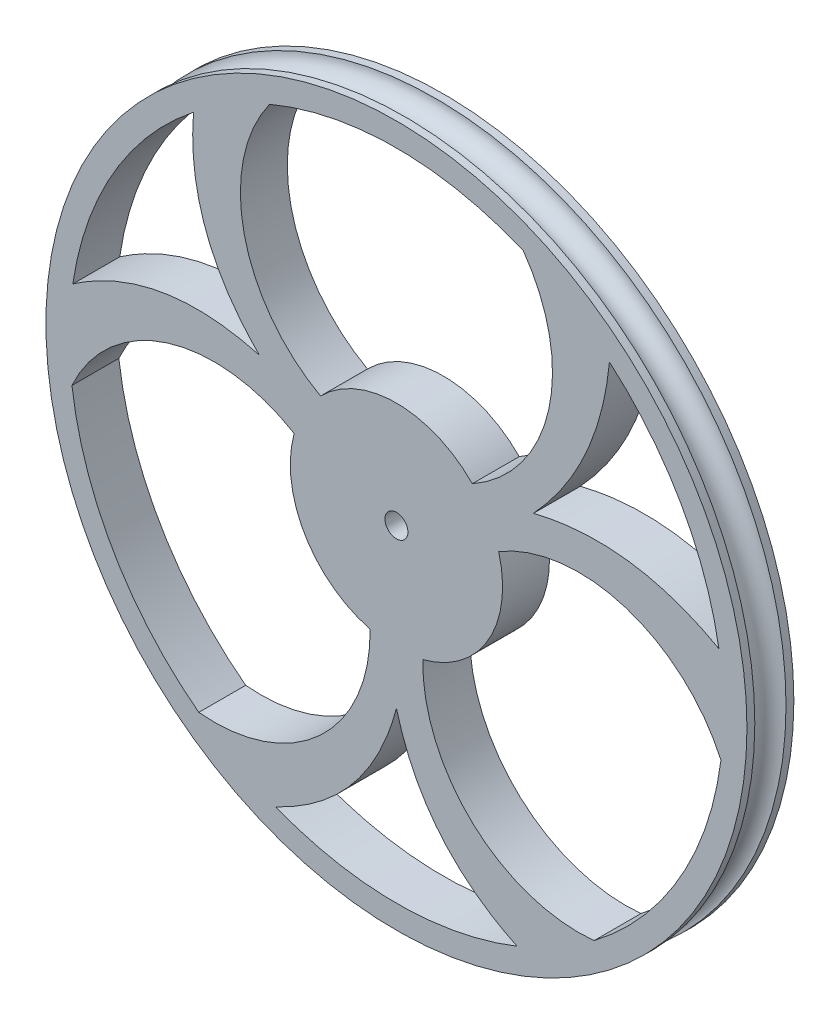
ISO-10303-21;
HEADER;
FILE_DESCRIPTION(('STEP AP214'),'2;1');
FILE_NAME('part.step','',(''),(''),'','','');
FILE_SCHEMA(('AUTOMOTIVE_DESIGN { 1 0 10303 214 1 1 1 1 }'));
ENDSEC;
DATA;
#1=APPLICATION_CONTEXT('core data for automotive mechanical design processes');
#2=APPLICATION_PROTOCOL_DEFINITION('international standard','automotive_design',2000,#1);
#3=PRODUCT_CONTEXT('',#1,'mechanical');
#4=PRODUCT('Part','Part','',(#3));
#5=PRODUCT_RELATED_PRODUCT_CATEGORY('part','',(#4));
#6=PRODUCT_DEFINITION_FORMATION('','',#4);
#7=PRODUCT_DEFINITION_CONTEXT('part definition',#1,'design');
#8=PRODUCT_DEFINITION('design','',#6,#7);
#9=PRODUCT_DEFINITION_SHAPE('','',#8);
#10=(LENGTH_UNIT() NAMED_UNIT(*) SI_UNIT(.MILLI.,.METRE.));
#11=(NAMED_UNIT(*) PLANE_ANGLE_UNIT() SI_UNIT($,.RADIAN.));
#12=(NAMED_UNIT(*) SI_UNIT($,.STERADIAN.) SOLID_ANGLE_UNIT());
#13=UNCERTAINTY_MEASURE_WITH_UNIT(LENGTH_MEASURE(1.E-05),#10,'distance_accuracy_value','');
#14=(GEOMETRIC_REPRESENTATION_CONTEXT(3) GLOBAL_UNCERTAINTY_ASSIGNED_CONTEXT((#13)) GLOBAL_UNIT_ASSIGNED_CONTEXT((#10,
#11,#12)) REPRESENTATION_CONTEXT('',''));
#15=CARTESIAN_POINT('',(0.,0.,0.));
#16=DIRECTION('',(0.,0.,1.));
#17=DIRECTION('',(1.,0.,0.));
#18=AXIS2_PLACEMENT_3D('',#15,#16,#17);
#19=CARTESIAN_POINT('',(0.,0.,1.7653));
#20=DIRECTION('',(0.,0.,1.));
#21=DIRECTION('',(1.,0.,0.));
#22=AXIS2_PLACEMENT_3D('',#19,#20,#21);
#23=CYLINDRICAL_SURFACE('',#22,37.0078);
#24=DIRECTION('',(0.,0.,1.));
#25=VECTOR('',#24,1.);
#26=CARTESIAN_POINT('',(-14.3540434226665,34.1106830517978,0.));
#27=LINE('',#26,#25);
#28=CARTESIAN_POINT('',(-14.3540434226665,34.1106830517978,-2.6543));
#29=VERTEX_POINT('',#28);
#30=CARTESIAN_POINT('',(-14.3540434226665,34.1106830517978,2.6543));
#31=VERTEX_POINT('',#30);
#32=EDGE_CURVE('E11',#29,#31,#27,.T.);
#33=ORIENTED_EDGE('',*,*,#32,.F.);
#34=CARTESIAN_POINT('',(0.,0.,-2.6543));
#35=DIRECTION('',(0.,0.,1.));
#36=DIRECTION('',(1.,0.,0.));
#37=AXIS2_PLACEMENT_3D('',#34,#35,#36);
#38=CIRCLE('',#37,37.0078);
#39=CARTESIAN_POINT('',(14.3540434226665,34.1106830517978,-2.6543));
#40=VERTEX_POINT('',#39);
#41=EDGE_CURVE('E411',#40,#29,#38,.T.);
#42=ORIENTED_EDGE('',*,*,#41,.F.);
#43=DIRECTION('',(0.,0.,1.));
#44=VECTOR('',#43,1.);
#45=CARTESIAN_POINT('',(14.3540434226665,34.1106830517978,0.));
#46=LINE('',#45,#44);
#47=CARTESIAN_POINT('',(14.3540434226665,34.1106830517978,2.6543));
#48=VERTEX_POINT('',#47);
#49=EDGE_CURVE('E436',#48,#40,#46,.F.);
#50=ORIENTED_EDGE('',*,*,#49,.F.);
#51=CARTESIAN_POINT('',(0.,0.,2.6543));
#52=DIRECTION('',(0.,0.,1.));
#53=DIRECTION('',(1.,0.,0.));
#54=AXIS2_PLACEMENT_3D('',#51,#52,#53);
#55=CIRCLE('',#54,37.0078);
#56=EDGE_CURVE('E413',#48,#31,#55,.T.);
#57=ORIENTED_EDGE('',*,*,#56,.T.);
#58=EDGE_LOOP('',(#33,#42,#50,#57));
#59=FACE_BOUND('',#58,.T.);
#60=ADVANCED_FACE('F38',(#59),#23,.F.);
#61=DIRECTION('',(0.,0.,1.));
#62=VECTOR('',#61,1.);
#63=CARTESIAN_POINT('',(-22.9602559710005,29.0241951927376,0.));
#64=LINE('',#63,#62);
#65=CARTESIAN_POINT('',(-22.9602559710005,29.0241951927376,2.65430000000003));
#66=VERTEX_POINT('',#65);
#67=CARTESIAN_POINT('',(-22.9602559710005,29.0241951927376,-2.6543));
#68=VERTEX_POINT('',#67);
#69=EDGE_CURVE('E46',#66,#68,#64,.F.);
#70=ORIENTED_EDGE('',*,*,#69,.F.);
#71=CARTESIAN_POINT('',(-36.6158183468092,5.37206735191132,2.6543));
#72=VERTEX_POINT('',#71);
#73=EDGE_CURVE('E802',#66,#72,#55,.T.);
#74=ORIENTED_EDGE('',*,*,#73,.T.);
#75=DIRECTION('',(0.,0.,1.));
#76=VECTOR('',#75,1.);
#77=CARTESIAN_POINT('',(-36.6158183468092,5.37206735191132,0.));
#78=LINE('',#77,#76);
#79=CARTESIAN_POINT('',(-36.6158183468092,5.37206735191133,-2.6543));
#80=VERTEX_POINT('',#79);
#81=EDGE_CURVE('E459',#80,#72,#78,.T.);
#82=ORIENTED_EDGE('',*,*,#81,.F.);
#83=EDGE_CURVE('E418',#68,#80,#38,.T.);
#84=ORIENTED_EDGE('',*,*,#83,.F.);
#85=EDGE_LOOP('',(#70,#74,#82,#84));
#86=FACE_BOUND('',#85,.T.);
#87=ADVANCED_FACE('F402',(#86),#23,.F.);
#88=DIRECTION('',(0.,0.,1.));
#89=VECTOR('',#88,1.);
#90=CARTESIAN_POINT('',(-36.7177397746294,-4.62437527484476,0.));
#91=LINE('',#90,#89);
#92=CARTESIAN_POINT('',(-36.7177397746294,-4.62437527484475,2.6543));
#93=VERTEX_POINT('',#92);
#94=CARTESIAN_POINT('',(-36.7177397746294,-4.62437527484474,-2.6543));
#95=VERTEX_POINT('',#94);
#96=EDGE_CURVE('E456',#93,#95,#91,.F.);
#97=ORIENTED_EDGE('',*,*,#96,.F.);
#98=CARTESIAN_POINT('',(-22.3636963519629,-29.486307776953,2.6543));
#99=VERTEX_POINT('',#98);
#100=EDGE_CURVE('E794',#93,#99,#55,.T.);
#101=ORIENTED_EDGE('',*,*,#100,.T.);
#102=DIRECTION('',(0.,0.,1.));
#103=VECTOR('',#102,1.);
#104=CARTESIAN_POINT('',(-22.3636963519629,-29.486307776953,0.));
#105=LINE('',#104,#103);
#106=CARTESIAN_POINT('',(-22.3636963519629,-29.486307776953,-2.6543));
#107=VERTEX_POINT('',#106);
#108=EDGE_CURVE('E453',#107,#99,#105,.T.);
#109=ORIENTED_EDGE('',*,*,#108,.F.);
#110=EDGE_CURVE('E423',#95,#107,#38,.T.);
#111=ORIENTED_EDGE('',*,*,#110,.F.);
#112=EDGE_LOOP('',(#97,#101,#109,#111));
#113=FACE_BOUND('',#112,.T.);
#114=ADVANCED_FACE('F407',(#113),#23,.F.);
#115=DIRECTION('',(0.,0.,1.));
#116=VECTOR('',#115,1.);
#117=CARTESIAN_POINT('',(-13.6555623758086,-34.3962625446487,0.));
#118=LINE('',#117,#116);
#119=CARTESIAN_POINT('',(-13.6555623758086,-34.3962625446487,2.65430000000003));
#120=VERTEX_POINT('',#119);
#121=CARTESIAN_POINT('',(-13.6555623758086,-34.3962625446487,-2.6543));
#122=VERTEX_POINT('',#121);
#123=EDGE_CURVE('E450',#120,#122,#118,.F.);
#124=ORIENTED_EDGE('',*,*,#123,.F.);
#125=CARTESIAN_POINT('',(13.6555623758085,-34.3962625446487,2.6543));
#126=VERTEX_POINT('',#125);
#127=EDGE_CURVE('E803',#120,#126,#55,.T.);
#128=ORIENTED_EDGE('',*,*,#127,.T.);
#129=DIRECTION('',(0.,0.,1.));
#130=VECTOR('',#129,1.);
#131=CARTESIAN_POINT('',(13.6555623758085,-34.3962625446487,0.));
#132=LINE('',#131,#130);
#133=CARTESIAN_POINT('',(13.6555623758085,-34.3962625446487,-2.6543));
#134=VERTEX_POINT('',#133);
#135=EDGE_CURVE('E447',#134,#126,#132,.T.);
#136=ORIENTED_EDGE('',*,*,#135,.F.);
#137=EDGE_CURVE('E806',#122,#134,#38,.T.);
#138=ORIENTED_EDGE('',*,*,#137,.F.);
#139=EDGE_LOOP('',(#124,#128,#136,#138));
#140=FACE_BOUND('',#139,.T.);
#141=ADVANCED_FACE('F647',(#140),#23,.F.);
#142=DIRECTION('',(0.,0.,1.));
#143=VECTOR('',#142,1.);
#144=CARTESIAN_POINT('',(22.3636963519629,-29.486307776953,0.));
#145=LINE('',#144,#143);
#146=CARTESIAN_POINT('',(22.3636963519629,-29.486307776953,2.6543));
#147=VERTEX_POINT('',#146);
#148=CARTESIAN_POINT('',(22.3636963519629,-29.486307776953,-2.6543));
#149=VERTEX_POINT('',#148);
#150=EDGE_CURVE('E445',#147,#149,#145,.F.);
#151=ORIENTED_EDGE('',*,*,#150,.F.);
#152=CARTESIAN_POINT('',(36.7177397746294,-4.62437527484471,2.6543));
#153=VERTEX_POINT('',#152);
#154=EDGE_CURVE('E191',#147,#153,#55,.T.);
#155=ORIENTED_EDGE('',*,*,#154,.T.);
#156=DIRECTION('',(0.,0.,1.));
#157=VECTOR('',#156,1.);
#158=CARTESIAN_POINT('',(36.7177397746294,-4.6243752748447,0.));
#159=LINE('',#158,#157);
#160=CARTESIAN_POINT('',(36.7177397746294,-4.62437527484471,-2.6543));
#161=VERTEX_POINT('',#160);
#162=EDGE_CURVE('E53',#161,#153,#159,.T.);
#163=ORIENTED_EDGE('',*,*,#162,.F.);
#164=EDGE_CURVE('E57',#149,#161,#38,.T.);
#165=ORIENTED_EDGE('',*,*,#164,.F.);
#166=EDGE_LOOP('',(#151,#155,#163,#165));
#167=FACE_BOUND('',#166,.T.);
#168=ADVANCED_FACE('F381',(#167),#23,.F.);
#169=CARTESIAN_POINT('',(0.,-39.6621,2.6543));
#170=DIRECTION('',(0.,0.,1.));
#171=DIRECTION('',(1.,0.,0.));
#172=AXIS2_PLACEMENT_3D('',#169,#170,#171);
#173=PLANE('',#172);
#174=CARTESIAN_POINT('',(0.,0.,2.6543));
#175=DIRECTION('',(0.,0.,-1.));
#176=DIRECTION('',(-1.,0.,0.));
#177=AXIS2_PLACEMENT_3D('',#174,#175,#176);
#178=CIRCLE('',#177,1.3);
#179=CARTESIAN_POINT('',(-1.3,0.,2.6543));
#180=VERTEX_POINT('',#179);
#181=EDGE_CURVE('E204',#180,#180,#178,.T.);
#182=ORIENTED_EDGE('',*,*,#181,.T.);
#183=EDGE_LOOP('',(#182));
#184=FACE_BOUND('',#183,.T.);
#185=ORIENTED_EDGE('',*,*,#73,.F.);
#186=CARTESIAN_POINT('',(-22.8389396296353,30.2415324815703,2.65430000000003));
#187=CARTESIAN_POINT('',(-24.3300339686592,17.7220709832498,2.65430000000003));
#188=CARTESIAN_POINT('',(-15.5064007741651,8.95262466112651,2.65430000000003));
#189=B_SPLINE_CURVE_WITH_KNOTS('',2,(#186,#187,#188),.UNSPECIFIED.,.F.,.F.,(3,3),(0.,1.),.UNSPECIFIED.);
#190=CARTESIAN_POINT('',(-15.5064007741651,8.95262466112651,2.65430000000005));
#191=VERTEX_POINT('',#190);
#192=EDGE_CURVE('E197',#66,#191,#189,.T.);
#193=ORIENTED_EDGE('',*,*,#192,.T.);
#194=CARTESIAN_POINT('',(-15.5064007741651,8.95262466112651,2.65430000000003));
#195=CARTESIAN_POINT('',(-27.5127806634949,12.2093920001725,2.65430000000003));
#196=CARTESIAN_POINT('',(-37.6094051932298,4.65833567397851,2.65430000000003));
#197=B_SPLINE_CURVE_WITH_KNOTS('',2,(#194,#195,#196),.UNSPECIFIED.,.F.,.F.,(3,3),(0.,1.),.UNSPECIFIED.);
#198=EDGE_CURVE('E470',#191,#72,#197,.T.);
#199=ORIENTED_EDGE('',*,*,#198,.T.);
#200=EDGE_LOOP('',(#185,#193,#199));
#201=FACE_BOUND('',#200,.T.);
#202=ORIENTED_EDGE('',*,*,#100,.F.);
#203=CARTESIAN_POINT('',(-20.6345572055509,-11.9133671572336,2.6543));
#204=DIRECTION('',(0.,0.,1.));
#205=DIRECTION('',(1.,0.,0.));
#206=AXIS2_PLACEMENT_3D('',#203,#204,#205);
#207=CIRCLE('',#206,17.6578074576614);
#208=CARTESIAN_POINT('',(-11.5673855302668,3.23868095590171,2.65430000000003));
#209=VERTEX_POINT('',#208);
#210=EDGE_CURVE('E472',#93,#209,#207,.F.);
#211=ORIENTED_EDGE('',*,*,#210,.T.);
#212=CARTESIAN_POINT('',(0.,0.,2.6543));
#213=DIRECTION('',(0.,0.,1.));
#214=DIRECTION('',(1.,0.,0.));
#215=AXIS2_PLACEMENT_3D('',#212,#213,#214);
#216=CIRCLE('',#215,12.0122213740817);
#217=CARTESIAN_POINT('',(-2.97891278256969,-11.6369902025304,2.65430000000003));
#218=VERTEX_POINT('',#217);
#219=EDGE_CURVE('E474',#209,#218,#216,.T.);
#220=ORIENTED_EDGE('',*,*,#219,.T.);
#221=CARTESIAN_POINT('',(-20.6345572055509,-11.9133671572336,2.6543));
#222=DIRECTION('',(0.,0.,1.));
#223=DIRECTION('',(1.,0.,0.));
#224=AXIS2_PLACEMENT_3D('',#221,#222,#223);
#225=CIRCLE('',#224,17.6578074576614);
#226=EDGE_CURVE('E489',#218,#99,#225,.F.);
#227=ORIENTED_EDGE('',*,*,#226,.T.);
#228=EDGE_LOOP('',(#202,#211,#220,#227));
#229=FACE_BOUND('',#228,.T.);
#230=ORIENTED_EDGE('',*,*,#127,.F.);
#231=CARTESIAN_POINT('',(-14.7704655635944,-34.8998681555486,2.65430000000003));
#232=CARTESIAN_POINT('',(-3.18274669483566,-29.9314629834221,2.65430000000003));
#233=CARTESIAN_POINT('',(0.,-17.9052493222529,2.65430000000003));
#234=B_SPLINE_CURVE_WITH_KNOTS('',2,(#231,#232,#233),.UNSPECIFIED.,.F.,.F.,(3,3),(0.,1.),.UNSPECIFIED.);
#235=CARTESIAN_POINT('',(0.,-17.9052493222529,2.65430000000005));
#236=VERTEX_POINT('',#235);
#237=EDGE_CURVE('E492',#120,#236,#234,.T.);
#238=ORIENTED_EDGE('',*,*,#237,.T.);
#239=CARTESIAN_POINT('',(0.,-17.9052493222529,2.65430000000003));
#240=CARTESIAN_POINT('',(3.18274669483566,-29.9314629834221,2.65430000000003));
#241=CARTESIAN_POINT('',(14.7704655635944,-34.8998681555486,2.65430000000003));
#242=B_SPLINE_CURVE_WITH_KNOTS('',2,(#239,#240,#241),.UNSPECIFIED.,.F.,.F.,(3,3),(0.,1.),.UNSPECIFIED.);
#243=EDGE_CURVE('E496',#236,#126,#242,.T.);
#244=ORIENTED_EDGE('',*,*,#243,.T.);
#245=EDGE_LOOP('',(#230,#238,#244));
#246=FACE_BOUND('',#245,.T.);
#247=ORIENTED_EDGE('',*,*,#154,.F.);
#248=CARTESIAN_POINT('',(20.6345572055509,-11.9133671572335,2.6543));
#249=DIRECTION('',(0.,0.,1.));
#250=DIRECTION('',(1.,0.,0.));
#251=AXIS2_PLACEMENT_3D('',#248,#249,#250);
#252=CIRCLE('',#251,17.6578074576614);
#253=CARTESIAN_POINT('',(2.97891278256964,-11.6369902025304,2.65430000000003));
#254=VERTEX_POINT('',#253);
#255=EDGE_CURVE('E504',#147,#254,#252,.F.);
#256=ORIENTED_EDGE('',*,*,#255,.T.);
#257=CARTESIAN_POINT('',(0.,0.,2.6543));
#258=DIRECTION('',(0.,0.,1.));
#259=DIRECTION('',(1.,0.,0.));
#260=AXIS2_PLACEMENT_3D('',#257,#258,#259);
#261=CIRCLE('',#260,12.0122213740817);
#262=CARTESIAN_POINT('',(11.5673855302668,3.23868095590169,2.65430000000003));
#263=VERTEX_POINT('',#262);
#264=EDGE_CURVE('E509',#254,#263,#261,.T.);
#265=ORIENTED_EDGE('',*,*,#264,.T.);
#266=CARTESIAN_POINT('',(20.6345572055509,-11.9133671572335,2.6543));
#267=DIRECTION('',(0.,0.,1.));
#268=DIRECTION('',(1.,0.,0.));
#269=AXIS2_PLACEMENT_3D('',#266,#267,#268);
#270=CIRCLE('',#269,17.6578074576614);
#271=EDGE_CURVE('E512',#263,#153,#270,.F.);
#272=ORIENTED_EDGE('',*,*,#271,.T.);
#273=EDGE_LOOP('',(#247,#256,#265,#272));
#274=FACE_BOUND('',#273,.T.);
#275=CARTESIAN_POINT('',(36.4878843218383,6.1815498506559,2.65430000000003));
#276=VERTEX_POINT('',#275);
#277=CARTESIAN_POINT('',(24.1027414849956,28.0826479119664,2.6543));
#278=VERTEX_POINT('',#277);
#279=EDGE_CURVE('E425',#276,#278,#55,.T.);
#280=ORIENTED_EDGE('',*,*,#279,.F.);
#281=CARTESIAN_POINT('',(37.480051650122,5.6047460731229,2.65430000000003));
#282=CARTESIAN_POINT('',(27.1410705281096,11.8521959487889,2.65430000000003));
#283=CARTESIAN_POINT('',(15.5064007741652,8.9526246611263,2.65430000000003));
#284=B_SPLINE_CURVE_WITH_KNOTS('',2,(#281,#282,#283),.UNSPECIFIED.,.F.,.F.,(3,3),(0.,1.),.UNSPECIFIED.);
#285=CARTESIAN_POINT('',(15.5064007741652,8.9526246611263,2.65430000000005));
#286=VERTEX_POINT('',#285);
#287=EDGE_CURVE('E515',#276,#286,#284,.T.);
#288=ORIENTED_EDGE('',*,*,#287,.T.);
#289=CARTESIAN_POINT('',(15.5064007741652,8.9526246611263,2.65430000000003));
#290=CARTESIAN_POINT('',(23.4309127099339,17.4969426650655,2.65430000000003));
#291=CARTESIAN_POINT('',(24.1898160745215,29.1722513447423,2.65430000000003));
#292=B_SPLINE_CURVE_WITH_KNOTS('',2,(#289,#290,#291),.UNSPECIFIED.,.F.,.F.,(3,3),(0.,1.),.UNSPECIFIED.);
#293=EDGE_CURVE('E211',#286,#278,#292,.T.);
#294=ORIENTED_EDGE('',*,*,#293,.T.);
#295=EDGE_LOOP('',(#280,#288,#294));
#296=FACE_BOUND('',#295,.T.);
#297=CARTESIAN_POINT('',(0.,23.8267343144671,2.6543));
#298=DIRECTION('',(0.,0.,1.));
#299=DIRECTION('',(1.,0.,0.));
#300=AXIS2_PLACEMENT_3D('',#297,#298,#299);
#301=CIRCLE('',#300,17.6578074576614);
#302=CARTESIAN_POINT('',(-8.58847274769715,8.3983092466287,2.65430000000003));
#303=VERTEX_POINT('',#302);
#304=EDGE_CURVE('E194',#303,#31,#301,.F.);
#305=ORIENTED_EDGE('',*,*,#304,.T.);
#306=ORIENTED_EDGE('',*,*,#56,.F.);
#307=CARTESIAN_POINT('',(0.,23.8267343144671,2.6543));
#308=DIRECTION('',(0.,0.,1.));
#309=DIRECTION('',(1.,0.,0.));
#310=AXIS2_PLACEMENT_3D('',#307,#308,#309);
#311=CIRCLE('',#310,17.6578074576614);
#312=CARTESIAN_POINT('',(8.58847274769714,8.39830924662869,2.6543));
#313=VERTEX_POINT('',#312);
#314=EDGE_CURVE('E201',#48,#313,#311,.F.);
#315=ORIENTED_EDGE('',*,*,#314,.T.);
#316=CARTESIAN_POINT('',(0.,0.,2.6543));
#317=DIRECTION('',(0.,0.,1.));
#318=DIRECTION('',(1.,0.,0.));
#319=AXIS2_PLACEMENT_3D('',#316,#317,#318);
#320=CIRCLE('',#319,12.0122213740817);
#321=EDGE_CURVE('E186',#313,#303,#320,.T.);
#322=ORIENTED_EDGE('',*,*,#321,.T.);
#323=EDGE_LOOP('',(#305,#306,#315,#322));
#324=FACE_BOUND('',#323,.T.);
#325=CARTESIAN_POINT('',(0.,0.,2.6543));
#326=DIRECTION('',(0.,0.,1.));
#327=DIRECTION('',(1.,0.,0.));
#328=AXIS2_PLACEMENT_3D('',#325,#326,#327);
#329=CIRCLE('',#328,39.6621);
#330=CARTESIAN_POINT('',(39.6621,0.,2.6543));
#331=VERTEX_POINT('',#330);
#332=EDGE_CURVE('E433',#331,#331,#329,.T.);
#333=ORIENTED_EDGE('',*,*,#332,.T.);
#334=EDGE_LOOP('',(#333));
#335=FACE_BOUND('',#334,.T.);
#336=ADVANCED_FACE('F40',(#184,#201,#229,#246,#274,#296,#324,#335),#173,.T.);
#337=CARTESIAN_POINT('',(0.,0.,1.7653));
#338=DIRECTION('',(0.,0.,1.));
#339=DIRECTION('',(1.,0.,0.));
#340=AXIS2_PLACEMENT_3D('',#337,#338,#339);
#341=CYLINDRICAL_SURFACE('',#340,39.6621);
#342=CARTESIAN_POINT('',(0.,0.,1.7653));
#343=DIRECTION('',(0.,0.,1.));
#344=DIRECTION('',(1.,0.,0.));
#345=AXIS2_PLACEMENT_3D('',#342,#343,#344);
#346=CIRCLE('',#345,39.6621);
#347=CARTESIAN_POINT('',(39.6621,0.,1.7653));
#348=VERTEX_POINT('',#347);
#349=EDGE_CURVE('E431',#348,#348,#346,.T.);
#350=ORIENTED_EDGE('',*,*,#349,.T.);
#351=EDGE_LOOP('',(#350));
#352=FACE_BOUND('',#351,.T.);
#353=ORIENTED_EDGE('',*,*,#332,.F.);
#354=EDGE_LOOP('',(#353));
#355=FACE_BOUND('',#354,.T.);
#356=ADVANCED_FACE('F391',(#352,#355),#341,.T.);
#357=CARTESIAN_POINT('',(0.,0.,0.));
#358=DIRECTION('',(0.,0.,1.));
#359=DIRECTION('',(1.,0.,0.));
#360=AXIS2_PLACEMENT_3D('',#357,#358,#359);
#361=TOROIDAL_SURFACE('',#360,39.6621,1.7653);
#362=CARTESIAN_POINT('',(0.,0.,-1.7653));
#363=DIRECTION('',(0.,0.,1.));
#364=DIRECTION('',(1.,0.,0.));
#365=AXIS2_PLACEMENT_3D('',#362,#363,#364);
#366=CIRCLE('',#365,39.6621);
#367=CARTESIAN_POINT('',(39.6621,0.,-1.7653));
#368=VERTEX_POINT('',#367);
#369=EDGE_CURVE('E428',#368,#368,#366,.T.);
#370=ORIENTED_EDGE('',*,*,#369,.T.);
#371=EDGE_LOOP('',(#370));
#372=FACE_BOUND('',#371,.T.);
#373=ORIENTED_EDGE('',*,*,#349,.F.);
#374=EDGE_LOOP('',(#373));
#375=FACE_BOUND('',#374,.T.);
#376=ADVANCED_FACE('F388',(#372,#375),#361,.F.);
#377=CARTESIAN_POINT('',(0.,0.,1.7653));
#378=DIRECTION('',(0.,0.,1.));
#379=DIRECTION('',(1.,0.,0.));
#380=AXIS2_PLACEMENT_3D('',#377,#378,#379);
#381=CYLINDRICAL_SURFACE('',#380,39.6621);
#382=CARTESIAN_POINT('',(0.,0.,-2.6543));
#383=DIRECTION('',(0.,0.,1.));
#384=DIRECTION('',(1.,0.,0.));
#385=AXIS2_PLACEMENT_3D('',#382,#383,#384);
#386=CIRCLE('',#385,39.6621);
#387=CARTESIAN_POINT('',(39.6621,0.,-2.6543));
#388=VERTEX_POINT('',#387);
#389=EDGE_CURVE('E421',#388,#388,#386,.T.);
#390=ORIENTED_EDGE('',*,*,#389,.T.);
#391=EDGE_LOOP('',(#390));
#392=FACE_BOUND('',#391,.T.);
#393=ORIENTED_EDGE('',*,*,#369,.F.);
#394=EDGE_LOOP('',(#393));
#395=FACE_BOUND('',#394,.T.);
#396=ADVANCED_FACE('F384',(#392,#395),#381,.T.);
#397=CARTESIAN_POINT('',(0.,-37.0078,-2.6543));
#398=DIRECTION('',(0.,0.,-1.));
#399=DIRECTION('',(-1.,0.,0.));
#400=AXIS2_PLACEMENT_3D('',#397,#398,#399);
#401=PLANE('',#400);
#402=CARTESIAN_POINT('',(0.,0.,-2.6543));
#403=DIRECTION('',(0.,0.,-1.));
#404=DIRECTION('',(-1.,0.,0.));
#405=AXIS2_PLACEMENT_3D('',#402,#403,#404);
#406=CIRCLE('',#405,2.3);
#407=CARTESIAN_POINT('',(-2.3,0.,-2.6543));
#408=VERTEX_POINT('',#407);
#409=EDGE_CURVE('E534',#408,#408,#406,.T.);
#410=ORIENTED_EDGE('',*,*,#409,.F.);
#411=EDGE_LOOP('',(#410));
#412=FACE_BOUND('',#411,.T.);
#413=ORIENTED_EDGE('',*,*,#41,.T.);
#414=CARTESIAN_POINT('',(0.,23.8267343144671,-2.6543));
#415=DIRECTION('',(0.,0.,-1.));
#416=DIRECTION('',(-1.,0.,0.));
#417=AXIS2_PLACEMENT_3D('',#414,#415,#416);
#418=CIRCLE('',#417,17.6578074576614);
#419=CARTESIAN_POINT('',(-8.58847274769715,8.3983092466287,-2.6543));
#420=VERTEX_POINT('',#419);
#421=EDGE_CURVE('E208',#420,#29,#418,.T.);
#422=ORIENTED_EDGE('',*,*,#421,.F.);
#423=CARTESIAN_POINT('',(0.,0.,-2.6543));
#424=DIRECTION('',(0.,0.,-1.));
#425=DIRECTION('',(-1.,0.,0.));
#426=AXIS2_PLACEMENT_3D('',#423,#424,#425);
#427=CIRCLE('',#426,12.0122213740817);
#428=CARTESIAN_POINT('',(8.58847274769714,8.39830924662869,-2.6543));
#429=VERTEX_POINT('',#428);
#430=EDGE_CURVE('E188',#429,#420,#427,.F.);
#431=ORIENTED_EDGE('',*,*,#430,.F.);
#432=CARTESIAN_POINT('',(0.,23.8267343144671,-2.6543));
#433=DIRECTION('',(0.,0.,-1.));
#434=DIRECTION('',(-1.,0.,0.));
#435=AXIS2_PLACEMENT_3D('',#432,#433,#434);
#436=CIRCLE('',#435,17.6578074576614);
#437=EDGE_CURVE('E214',#40,#429,#436,.T.);
#438=ORIENTED_EDGE('',*,*,#437,.F.);
#439=EDGE_LOOP('',(#413,#422,#431,#438));
#440=FACE_BOUND('',#439,.T.);
#441=ORIENTED_EDGE('',*,*,#83,.T.);
#442=CARTESIAN_POINT('',(-15.5064007741651,8.95262466112651,-2.65430000000003));
#443=CARTESIAN_POINT('',(-27.5127806634949,12.2093920001725,-2.65430000000003));
#444=CARTESIAN_POINT('',(-37.6094051932298,4.65833567397851,-2.65430000000003));
#445=B_SPLINE_CURVE_WITH_KNOTS('',2,(#442,#443,#444),.UNSPECIFIED.,.F.,.F.,(3,3),(0.,1.),.UNSPECIFIED.);
#446=CARTESIAN_POINT('',(-15.5064007741651,8.95262466112651,-2.65430000000003));
#447=VERTEX_POINT('',#446);
#448=EDGE_CURVE('E268',#447,#80,#445,.T.);
#449=ORIENTED_EDGE('',*,*,#448,.F.);
#450=CARTESIAN_POINT('',(-22.8389396296353,30.2415324815703,-2.65430000000003));
#451=CARTESIAN_POINT('',(-24.3300339686592,17.7220709832498,-2.65430000000003));
#452=CARTESIAN_POINT('',(-15.5064007741651,8.95262466112651,-2.65430000000003));
#453=B_SPLINE_CURVE_WITH_KNOTS('',2,(#450,#451,#452),.UNSPECIFIED.,.F.,.F.,(3,3),(0.,1.),.UNSPECIFIED.);
#454=EDGE_CURVE('E210',#68,#447,#453,.T.);
#455=ORIENTED_EDGE('',*,*,#454,.F.);
#456=EDGE_LOOP('',(#441,#449,#455));
#457=FACE_BOUND('',#456,.T.);
#458=ORIENTED_EDGE('',*,*,#110,.T.);
#459=CARTESIAN_POINT('',(-20.6345572055509,-11.9133671572336,-2.6543));
#460=DIRECTION('',(0.,0.,-1.));
#461=DIRECTION('',(-1.,0.,0.));
#462=AXIS2_PLACEMENT_3D('',#459,#460,#461);
#463=CIRCLE('',#462,17.6578074576614);
#464=CARTESIAN_POINT('',(-2.97891278256969,-11.6369902025304,-2.6543));
#465=VERTEX_POINT('',#464);
#466=EDGE_CURVE('E255',#465,#107,#463,.T.);
#467=ORIENTED_EDGE('',*,*,#466,.F.);
#468=CARTESIAN_POINT('',(0.,0.,-2.6543));
#469=DIRECTION('',(0.,0.,-1.));
#470=DIRECTION('',(-1.,0.,0.));
#471=AXIS2_PLACEMENT_3D('',#468,#469,#470);
#472=CIRCLE('',#471,12.0122213740817);
#473=CARTESIAN_POINT('',(-11.5673855302668,3.23868095590171,-2.6543));
#474=VERTEX_POINT('',#473);
#475=EDGE_CURVE('E262',#474,#465,#472,.F.);
#476=ORIENTED_EDGE('',*,*,#475,.F.);
#477=CARTESIAN_POINT('',(-20.6345572055509,-11.9133671572336,-2.6543));
#478=DIRECTION('',(0.,0.,-1.));
#479=DIRECTION('',(-1.,0.,0.));
#480=AXIS2_PLACEMENT_3D('',#477,#478,#479);
#481=CIRCLE('',#480,17.6578074576614);
#482=EDGE_CURVE('E266',#95,#474,#481,.T.);
#483=ORIENTED_EDGE('',*,*,#482,.F.);
#484=EDGE_LOOP('',(#458,#467,#476,#483));
#485=FACE_BOUND('',#484,.T.);
#486=ORIENTED_EDGE('',*,*,#137,.T.);
#487=CARTESIAN_POINT('',(0.,-17.9052493222529,-2.65430000000003));
#488=CARTESIAN_POINT('',(3.18274669483566,-29.9314629834221,-2.65430000000003));
#489=CARTESIAN_POINT('',(14.7704655635944,-34.8998681555486,-2.65430000000003));
#490=B_SPLINE_CURVE_WITH_KNOTS('',2,(#487,#488,#489),.UNSPECIFIED.,.F.,.F.,(3,3),(0.,1.),.UNSPECIFIED.);
#491=CARTESIAN_POINT('',(0.,-17.9052493222529,-2.65430000000003));
#492=VERTEX_POINT('',#491);
#493=EDGE_CURVE('E242',#492,#134,#490,.T.);
#494=ORIENTED_EDGE('',*,*,#493,.F.);
#495=CARTESIAN_POINT('',(-14.7704655635944,-34.8998681555486,-2.65430000000003));
#496=CARTESIAN_POINT('',(-3.18274669483566,-29.9314629834221,-2.65430000000003));
#497=CARTESIAN_POINT('',(0.,-17.9052493222529,-2.65430000000003));
#498=B_SPLINE_CURVE_WITH_KNOTS('',2,(#495,#496,#497),.UNSPECIFIED.,.F.,.F.,(3,3),(0.,1.),.UNSPECIFIED.);
#499=EDGE_CURVE('E248',#122,#492,#498,.T.);
#500=ORIENTED_EDGE('',*,*,#499,.F.);
#501=EDGE_LOOP('',(#486,#494,#500));
#502=FACE_BOUND('',#501,.T.);
#503=ORIENTED_EDGE('',*,*,#164,.T.);
#504=CARTESIAN_POINT('',(20.6345572055509,-11.9133671572335,-2.6543));
#505=DIRECTION('',(0.,0.,-1.));
#506=DIRECTION('',(-1.,0.,0.));
#507=AXIS2_PLACEMENT_3D('',#504,#505,#506);
#508=CIRCLE('',#507,17.6578074576614);
#509=CARTESIAN_POINT('',(11.5673855302668,3.23868095590169,-2.6543));
#510=VERTEX_POINT('',#509);
#511=EDGE_CURVE('E229',#510,#161,#508,.T.);
#512=ORIENTED_EDGE('',*,*,#511,.F.);
#513=CARTESIAN_POINT('',(0.,0.,-2.6543));
#514=DIRECTION('',(0.,0.,-1.));
#515=DIRECTION('',(-1.,0.,0.));
#516=AXIS2_PLACEMENT_3D('',#513,#514,#515);
#517=CIRCLE('',#516,12.0122213740817);
#518=CARTESIAN_POINT('',(2.97891278256964,-11.6369902025304,-2.6543));
#519=VERTEX_POINT('',#518);
#520=EDGE_CURVE('E236',#519,#510,#517,.F.);
#521=ORIENTED_EDGE('',*,*,#520,.F.);
#522=CARTESIAN_POINT('',(20.6345572055509,-11.9133671572335,-2.6543));
#523=DIRECTION('',(0.,0.,-1.));
#524=DIRECTION('',(-1.,0.,0.));
#525=AXIS2_PLACEMENT_3D('',#522,#523,#524);
#526=CIRCLE('',#525,17.6578074576614);
#527=EDGE_CURVE('E240',#149,#519,#526,.T.);
#528=ORIENTED_EDGE('',*,*,#527,.F.);
#529=EDGE_LOOP('',(#503,#512,#521,#528));
#530=FACE_BOUND('',#529,.T.);
#531=CARTESIAN_POINT('',(36.4878843218383,6.1815498506559,-2.6543));
#532=VERTEX_POINT('',#531);
#533=CARTESIAN_POINT('',(24.1027414849956,28.0826479119664,-2.6543));
#534=VERTEX_POINT('',#533);
#535=EDGE_CURVE('E417',#532,#534,#38,.T.);
#536=ORIENTED_EDGE('',*,*,#535,.T.);
#537=CARTESIAN_POINT('',(15.5064007741652,8.9526246611263,-2.65430000000003));
#538=CARTESIAN_POINT('',(23.4309127099339,17.4969426650655,-2.65430000000003));
#539=CARTESIAN_POINT('',(24.1898160745215,29.1722513447423,-2.65430000000003));
#540=B_SPLINE_CURVE_WITH_KNOTS('',2,(#537,#538,#539),.UNSPECIFIED.,.F.,.F.,(3,3),(0.,1.),.UNSPECIFIED.);
#541=CARTESIAN_POINT('',(15.5064007741652,8.9526246611263,-2.65430000000003));
#542=VERTEX_POINT('',#541);
#543=EDGE_CURVE('E216',#542,#534,#540,.T.);
#544=ORIENTED_EDGE('',*,*,#543,.F.);
#545=CARTESIAN_POINT('',(37.480051650122,5.6047460731229,-2.65430000000003));
#546=CARTESIAN_POINT('',(27.1410705281096,11.8521959487889,-2.65430000000003));
#547=CARTESIAN_POINT('',(15.5064007741652,8.9526246611263,-2.65430000000003));
#548=B_SPLINE_CURVE_WITH_KNOTS('',2,(#545,#546,#547),.UNSPECIFIED.,.F.,.F.,(3,3),(0.,1.),.UNSPECIFIED.);
#549=EDGE_CURVE('E222',#532,#542,#548,.T.);
#550=ORIENTED_EDGE('',*,*,#549,.F.);
#551=EDGE_LOOP('',(#536,#544,#550));
#552=FACE_BOUND('',#551,.T.);
#553=ORIENTED_EDGE('',*,*,#389,.F.);
#554=EDGE_LOOP('',(#553));
#555=FACE_BOUND('',#554,.T.);
#556=ADVANCED_FACE('F379',(#412,#440,#457,#485,#502,#530,#552,#555),#401,.T.);
#557=DIRECTION('',(0.,0.,1.));
#558=VECTOR('',#557,1.);
#559=CARTESIAN_POINT('',(36.4878843218383,6.1815498506559,0.));
#560=LINE('',#559,#558);
#561=EDGE_CURVE('E441',#276,#532,#560,.F.);
#562=ORIENTED_EDGE('',*,*,#561,.F.);
#563=ORIENTED_EDGE('',*,*,#279,.T.);
#564=DIRECTION('',(0.,0.,1.));
#565=VECTOR('',#564,1.);
#566=CARTESIAN_POINT('',(24.102741484991,28.0826479119611,0.));
#567=LINE('',#566,#565);
#568=EDGE_CURVE('E438',#534,#278,#567,.T.);
#569=ORIENTED_EDGE('',*,*,#568,.F.);
#570=ORIENTED_EDGE('',*,*,#535,.F.);
#571=EDGE_LOOP('',(#562,#563,#569,#570));
#572=FACE_BOUND('',#571,.T.);
#573=ADVANCED_FACE('F376',(#572),#23,.F.);
#574=CARTESIAN_POINT('',(0.,23.8267343144671,-106.10451568724));
#575=DIRECTION('',(0.,0.,1.));
#576=DIRECTION('',(1.,0.,0.));
#577=AXIS2_PLACEMENT_3D('',#574,#575,#576);
#578=CYLINDRICAL_SURFACE('',#577,17.6578074576614);
#579=ORIENTED_EDGE('',*,*,#421,.T.);
#580=ORIENTED_EDGE('',*,*,#32,.T.);
#581=ORIENTED_EDGE('',*,*,#304,.F.);
#582=DIRECTION('',(0.,0.,1.));
#583=VECTOR('',#582,1.);
#584=CARTESIAN_POINT('',(-8.58847274769715,8.3983092466287,-106.10451568724));
#585=LINE('',#584,#583);
#586=EDGE_CURVE('E181',#420,#303,#585,.T.);
#587=ORIENTED_EDGE('',*,*,#586,.F.);
#588=EDGE_LOOP('',(#579,#580,#581,#587));
#589=FACE_BOUND('',#588,.T.);
#590=ADVANCED_FACE('F195',(#589),#578,.F.);
#591=CARTESIAN_POINT('',(-22.8389396296353,30.2415324815703,-106.10451568724));
#592=CARTESIAN_POINT('',(-24.3300339686592,17.7220709832498,-106.10451568724));
#593=CARTESIAN_POINT('',(-15.5064007741651,8.95262466112651,-106.10451568724));
#594=B_SPLINE_CURVE_WITH_KNOTS('',2,(#591,#592,#593),.UNSPECIFIED.,.F.,.F.,(3,3),(0.,1.),.UNSPECIFIED.);
#595=DIRECTION('',(0.,0.,1.));
#596=VECTOR('',#595,1.);
#597=SURFACE_OF_LINEAR_EXTRUSION('',#594,#596);
#598=ORIENTED_EDGE('',*,*,#192,.F.);
#599=ORIENTED_EDGE('',*,*,#69,.T.);
#600=ORIENTED_EDGE('',*,*,#454,.T.);
#601=DIRECTION('',(0.,0.,1.));
#602=VECTOR('',#601,1.);
#603=CARTESIAN_POINT('',(-15.5064007741651,8.95262466112651,-106.10451568724));
#604=LINE('',#603,#602);
#605=EDGE_CURVE('E273',#447,#191,#604,.T.);
#606=ORIENTED_EDGE('',*,*,#605,.T.);
#607=EDGE_LOOP('',(#598,#599,#600,#606));
#608=FACE_BOUND('',#607,.T.);
#609=ADVANCED_FACE('F368',(#608),#597,.T.);
#610=CARTESIAN_POINT('',(-15.5064007741651,8.95262466112651,-106.10451568724));
#611=CARTESIAN_POINT('',(-27.5127806634949,12.2093920001725,-106.10451568724));
#612=CARTESIAN_POINT('',(-37.6094051932298,4.65833567397851,-106.10451568724));
#613=B_SPLINE_CURVE_WITH_KNOTS('',2,(#610,#611,#612),.UNSPECIFIED.,.F.,.F.,(3,3),(0.,1.),.UNSPECIFIED.);
#614=DIRECTION('',(0.,0.,1.));
#615=VECTOR('',#614,1.);
#616=SURFACE_OF_LINEAR_EXTRUSION('',#613,#615);
#617=ORIENTED_EDGE('',*,*,#448,.T.);
#618=ORIENTED_EDGE('',*,*,#81,.T.);
#619=ORIENTED_EDGE('',*,*,#198,.F.);
#620=ORIENTED_EDGE('',*,*,#605,.F.);
#621=EDGE_LOOP('',(#617,#618,#619,#620));
#622=FACE_BOUND('',#621,.T.);
#623=ADVANCED_FACE('F363',(#622),#616,.T.);
#624=CARTESIAN_POINT('',(-20.6345572055509,-11.9133671572336,-106.10451568724));
#625=DIRECTION('',(0.,0.,1.));
#626=DIRECTION('',(1.,0.,0.));
#627=AXIS2_PLACEMENT_3D('',#624,#625,#626);
#628=CYLINDRICAL_SURFACE('',#627,17.6578074576614);
#629=ORIENTED_EDGE('',*,*,#210,.F.);
#630=ORIENTED_EDGE('',*,*,#96,.T.);
#631=ORIENTED_EDGE('',*,*,#482,.T.);
#632=DIRECTION('',(0.,0.,1.));
#633=VECTOR('',#632,1.);
#634=CARTESIAN_POINT('',(-11.5673855302668,3.23868095590171,-106.10451568724));
#635=LINE('',#634,#633);
#636=EDGE_CURVE('E265',#474,#209,#635,.T.);
#637=ORIENTED_EDGE('',*,*,#636,.T.);
#638=EDGE_LOOP('',(#629,#630,#631,#637));
#639=FACE_BOUND('',#638,.T.);
#640=ADVANCED_FACE('F367',(#639),#628,.F.);
#641=CARTESIAN_POINT('',(0.,0.,-106.10451568724));
#642=DIRECTION('',(0.,0.,1.));
#643=DIRECTION('',(1.,0.,0.));
#644=AXIS2_PLACEMENT_3D('',#641,#642,#643);
#645=CYLINDRICAL_SURFACE('',#644,12.0122213740817);
#646=ORIENTED_EDGE('',*,*,#636,.F.);
#647=ORIENTED_EDGE('',*,*,#475,.T.);
#648=DIRECTION('',(0.,0.,1.));
#649=VECTOR('',#648,1.);
#650=CARTESIAN_POINT('',(-2.97891278256969,-11.6369902025304,-106.10451568724));
#651=LINE('',#650,#649);
#652=EDGE_CURVE('E261',#465,#218,#651,.T.);
#653=ORIENTED_EDGE('',*,*,#652,.T.);
#654=ORIENTED_EDGE('',*,*,#219,.F.);
#655=EDGE_LOOP('',(#646,#647,#653,#654));
#656=FACE_BOUND('',#655,.T.);
#657=ADVANCED_FACE('F593',(#656),#645,.T.);
#658=CARTESIAN_POINT('',(-20.6345572055509,-11.9133671572336,-106.10451568724));
#659=DIRECTION('',(0.,0.,1.));
#660=DIRECTION('',(1.,0.,0.));
#661=AXIS2_PLACEMENT_3D('',#658,#659,#660);
#662=CYLINDRICAL_SURFACE('',#661,17.6578074576614);
#663=ORIENTED_EDGE('',*,*,#466,.T.);
#664=ORIENTED_EDGE('',*,*,#108,.T.);
#665=ORIENTED_EDGE('',*,*,#226,.F.);
#666=ORIENTED_EDGE('',*,*,#652,.F.);
#667=EDGE_LOOP('',(#663,#664,#665,#666));
#668=FACE_BOUND('',#667,.T.);
#669=ADVANCED_FACE('F586',(#668),#662,.F.);
#670=CARTESIAN_POINT('',(-14.7704655635944,-34.8998681555486,-106.10451568724));
#671=CARTESIAN_POINT('',(-3.18274669483566,-29.9314629834221,-106.10451568724));
#672=CARTESIAN_POINT('',(0.,-17.9052493222529,-106.10451568724));
#673=B_SPLINE_CURVE_WITH_KNOTS('',2,(#670,#671,#672),.UNSPECIFIED.,.F.,.F.,(3,3),(0.,1.),.UNSPECIFIED.);
#674=DIRECTION('',(0.,0.,1.));
#675=VECTOR('',#674,1.);
#676=SURFACE_OF_LINEAR_EXTRUSION('',#673,#675);
#677=ORIENTED_EDGE('',*,*,#237,.F.);
#678=ORIENTED_EDGE('',*,*,#123,.T.);
#679=ORIENTED_EDGE('',*,*,#499,.T.);
#680=DIRECTION('',(0.,0.,1.));
#681=VECTOR('',#680,1.);
#682=CARTESIAN_POINT('',(0.,-17.9052493222529,-106.10451568724));
#683=LINE('',#682,#681);
#684=EDGE_CURVE('E247',#492,#236,#683,.T.);
#685=ORIENTED_EDGE('',*,*,#684,.T.);
#686=EDGE_LOOP('',(#677,#678,#679,#685));
#687=FACE_BOUND('',#686,.T.);
#688=ADVANCED_FACE('F334',(#687),#676,.T.);
#689=CARTESIAN_POINT('',(0.,-17.9052493222529,-106.10451568724));
#690=CARTESIAN_POINT('',(3.18274669483566,-29.9314629834221,-106.10451568724));
#691=CARTESIAN_POINT('',(14.7704655635944,-34.8998681555486,-106.10451568724));
#692=B_SPLINE_CURVE_WITH_KNOTS('',2,(#689,#690,#691),.UNSPECIFIED.,.F.,.F.,(3,3),(0.,1.),.UNSPECIFIED.);
#693=DIRECTION('',(0.,0.,1.));
#694=VECTOR('',#693,1.);
#695=SURFACE_OF_LINEAR_EXTRUSION('',#692,#694);
#696=ORIENTED_EDGE('',*,*,#493,.T.);
#697=ORIENTED_EDGE('',*,*,#135,.T.);
#698=ORIENTED_EDGE('',*,*,#243,.F.);
#699=ORIENTED_EDGE('',*,*,#684,.F.);
#700=EDGE_LOOP('',(#696,#697,#698,#699));
#701=FACE_BOUND('',#700,.T.);
#702=ADVANCED_FACE('F330',(#701),#695,.T.);
#703=CARTESIAN_POINT('',(20.6345572055509,-11.9133671572335,-106.10451568724));
#704=DIRECTION('',(0.,0.,1.));
#705=DIRECTION('',(1.,0.,0.));
#706=AXIS2_PLACEMENT_3D('',#703,#704,#705);
#707=CYLINDRICAL_SURFACE('',#706,17.6578074576614);
#708=ORIENTED_EDGE('',*,*,#255,.F.);
#709=ORIENTED_EDGE('',*,*,#150,.T.);
#710=ORIENTED_EDGE('',*,*,#527,.T.);
#711=DIRECTION('',(0.,0.,1.));
#712=VECTOR('',#711,1.);
#713=CARTESIAN_POINT('',(2.97891278256964,-11.6369902025304,-106.10451568724));
#714=LINE('',#713,#712);
#715=EDGE_CURVE('E239',#519,#254,#714,.T.);
#716=ORIENTED_EDGE('',*,*,#715,.T.);
#717=EDGE_LOOP('',(#708,#709,#710,#716));
#718=FACE_BOUND('',#717,.T.);
#719=ADVANCED_FACE('F326',(#718),#707,.F.);
#720=CARTESIAN_POINT('',(0.,0.,-106.10451568724));
#721=DIRECTION('',(0.,0.,1.));
#722=DIRECTION('',(1.,0.,0.));
#723=AXIS2_PLACEMENT_3D('',#720,#721,#722);
#724=CYLINDRICAL_SURFACE('',#723,12.0122213740817);
#725=ORIENTED_EDGE('',*,*,#715,.F.);
#726=ORIENTED_EDGE('',*,*,#520,.T.);
#727=DIRECTION('',(0.,0.,1.));
#728=VECTOR('',#727,1.);
#729=CARTESIAN_POINT('',(11.5673855302668,3.23868095590169,-106.10451568724));
#730=LINE('',#729,#728);
#731=EDGE_CURVE('E235',#510,#263,#730,.T.);
#732=ORIENTED_EDGE('',*,*,#731,.T.);
#733=ORIENTED_EDGE('',*,*,#264,.F.);
#734=EDGE_LOOP('',(#725,#726,#732,#733));
#735=FACE_BOUND('',#734,.T.);
#736=ADVANCED_FACE('F322',(#735),#724,.T.);
#737=CARTESIAN_POINT('',(20.6345572055509,-11.9133671572335,-106.10451568724));
#738=DIRECTION('',(0.,0.,1.));
#739=DIRECTION('',(1.,0.,0.));
#740=AXIS2_PLACEMENT_3D('',#737,#738,#739);
#741=CYLINDRICAL_SURFACE('',#740,17.6578074576614);
#742=ORIENTED_EDGE('',*,*,#511,.T.);
#743=ORIENTED_EDGE('',*,*,#162,.T.);
#744=ORIENTED_EDGE('',*,*,#271,.F.);
#745=ORIENTED_EDGE('',*,*,#731,.F.);
#746=EDGE_LOOP('',(#742,#743,#744,#745));
#747=FACE_BOUND('',#746,.T.);
#748=ADVANCED_FACE('F318',(#747),#741,.F.);
#749=CARTESIAN_POINT('',(37.480051650122,5.6047460731229,-106.10451568724));
#750=CARTESIAN_POINT('',(27.1410705281096,11.8521959487889,-106.10451568724));
#751=CARTESIAN_POINT('',(15.5064007741652,8.9526246611263,-106.10451568724));
#752=B_SPLINE_CURVE_WITH_KNOTS('',2,(#749,#750,#751),.UNSPECIFIED.,.F.,.F.,(3,3),(0.,1.),.UNSPECIFIED.);
#753=DIRECTION('',(0.,0.,1.));
#754=VECTOR('',#753,1.);
#755=SURFACE_OF_LINEAR_EXTRUSION('',#752,#754);
#756=ORIENTED_EDGE('',*,*,#287,.F.);
#757=ORIENTED_EDGE('',*,*,#561,.T.);
#758=ORIENTED_EDGE('',*,*,#549,.T.);
#759=DIRECTION('',(0.,0.,1.));
#760=VECTOR('',#759,1.);
#761=CARTESIAN_POINT('',(15.5064007741652,8.9526246611263,-106.10451568724));
#762=LINE('',#761,#760);
#763=EDGE_CURVE('E221',#542,#286,#762,.T.);
#764=ORIENTED_EDGE('',*,*,#763,.T.);
#765=EDGE_LOOP('',(#756,#757,#758,#764));
#766=FACE_BOUND('',#765,.T.);
#767=ADVANCED_FACE('F313',(#766),#755,.T.);
#768=CARTESIAN_POINT('',(15.5064007741652,8.9526246611263,-106.10451568724));
#769=CARTESIAN_POINT('',(23.4309127099339,17.4969426650655,-106.10451568724));
#770=CARTESIAN_POINT('',(24.1898160745215,29.1722513447423,-106.10451568724));
#771=B_SPLINE_CURVE_WITH_KNOTS('',2,(#768,#769,#770),.UNSPECIFIED.,.F.,.F.,(3,3),(0.,1.),.UNSPECIFIED.);
#772=DIRECTION('',(0.,0.,1.));
#773=VECTOR('',#772,1.);
#774=SURFACE_OF_LINEAR_EXTRUSION('',#771,#773);
#775=ORIENTED_EDGE('',*,*,#543,.T.);
#776=ORIENTED_EDGE('',*,*,#568,.T.);
#777=ORIENTED_EDGE('',*,*,#293,.F.);
#778=ORIENTED_EDGE('',*,*,#763,.F.);
#779=EDGE_LOOP('',(#775,#776,#777,#778));
#780=FACE_BOUND('',#779,.T.);
#781=ADVANCED_FACE('F308',(#780),#774,.T.);
#782=CARTESIAN_POINT('',(0.,23.8267343144671,-106.10451568724));
#783=DIRECTION('',(0.,0.,1.));
#784=DIRECTION('',(1.,0.,0.));
#785=AXIS2_PLACEMENT_3D('',#782,#783,#784);
#786=CYLINDRICAL_SURFACE('',#785,17.6578074576614);
#787=ORIENTED_EDGE('',*,*,#314,.F.);
#788=ORIENTED_EDGE('',*,*,#49,.T.);
#789=ORIENTED_EDGE('',*,*,#437,.T.);
#790=DIRECTION('',(0.,0.,1.));
#791=VECTOR('',#790,1.);
#792=CARTESIAN_POINT('',(8.58847274769714,8.39830924662869,-106.10451568724));
#793=LINE('',#792,#791);
#794=EDGE_CURVE('E213',#429,#313,#793,.T.);
#795=ORIENTED_EDGE('',*,*,#794,.T.);
#796=EDGE_LOOP('',(#787,#788,#789,#795));
#797=FACE_BOUND('',#796,.T.);
#798=ADVANCED_FACE('F312',(#797),#786,.F.);
#799=CARTESIAN_POINT('',(0.,0.,-106.10451568724));
#800=DIRECTION('',(0.,0.,1.));
#801=DIRECTION('',(1.,0.,0.));
#802=AXIS2_PLACEMENT_3D('',#799,#800,#801);
#803=CYLINDRICAL_SURFACE('',#802,12.0122213740817);
#804=ORIENTED_EDGE('',*,*,#794,.F.);
#805=ORIENTED_EDGE('',*,*,#430,.T.);
#806=ORIENTED_EDGE('',*,*,#586,.T.);
#807=ORIENTED_EDGE('',*,*,#321,.F.);
#808=EDGE_LOOP('',(#804,#805,#806,#807));
#809=FACE_BOUND('',#808,.T.);
#810=ADVANCED_FACE('F184',(#809),#803,.T.);
#811=CARTESIAN_POINT('',(0.,0.,-2.6543));
#812=DIRECTION('',(0.,0.,-1.));
#813=DIRECTION('',(-1.,0.,0.));
#814=AXIS2_PLACEMENT_3D('',#811,#812,#813);
#815=CYLINDRICAL_SURFACE('',#814,1.3);
#816=ORIENTED_EDGE('',*,*,#181,.F.);
#817=EDGE_LOOP('',(#816));
#818=FACE_BOUND('',#817,.T.);
#819=CARTESIAN_POINT('',(0.,0.,-1.68861122519292));
#820=DIRECTION('',(0.,0.,-1.));
#821=DIRECTION('',(-1.,0.,0.));
#822=AXIS2_PLACEMENT_3D('',#819,#820,#821);
#823=CIRCLE('',#822,1.3);
#824=CARTESIAN_POINT('',(-1.3,0.,-1.68861122519292));
#825=VERTEX_POINT('',#824);
#826=EDGE_CURVE('E531',#825,#825,#823,.T.);
#827=ORIENTED_EDGE('',*,*,#826,.T.);
#828=EDGE_LOOP('',(#827));
#829=FACE_BOUND('',#828,.T.);
#830=ADVANCED_FACE('F540',(#818,#829),#815,.F.);
#831=CARTESIAN_POINT('',(0.,0.,-2.6543));
#832=DIRECTION('',(0.,0.,-1.));
#833=DIRECTION('',(-1.,0.,0.));
#834=AXIS2_PLACEMENT_3D('',#831,#832,#833);
#835=CONICAL_SURFACE('',#834,2.3,0.802851455917391);
#836=ORIENTED_EDGE('',*,*,#826,.F.);
#837=EDGE_LOOP('',(#836));
#838=FACE_BOUND('',#837,.T.);
#839=ORIENTED_EDGE('',*,*,#409,.T.);
#840=EDGE_LOOP('',(#839));
#841=FACE_BOUND('',#840,.T.);
#842=ADVANCED_FACE('F538',(#838,#841),#835,.F.);
#843=CLOSED_SHELL('',(#60,#87,#114,#141,#168,#336,#356,#376,#396,#556,#573,#590,#609,#623,#640,
#657,#669,#688,#702,#719,#736,#748,#767,#781,#798,#810,#830,#842));
#844=MANIFOLD_SOLID_BREP('B2',#843);
#845=ADVANCED_BREP_SHAPE_REPRESENTATION('',(#18,#844),#14);
#846=SHAPE_DEFINITION_REPRESENTATION(#9,#845);
ENDSEC;
END-ISO-10303-21;
